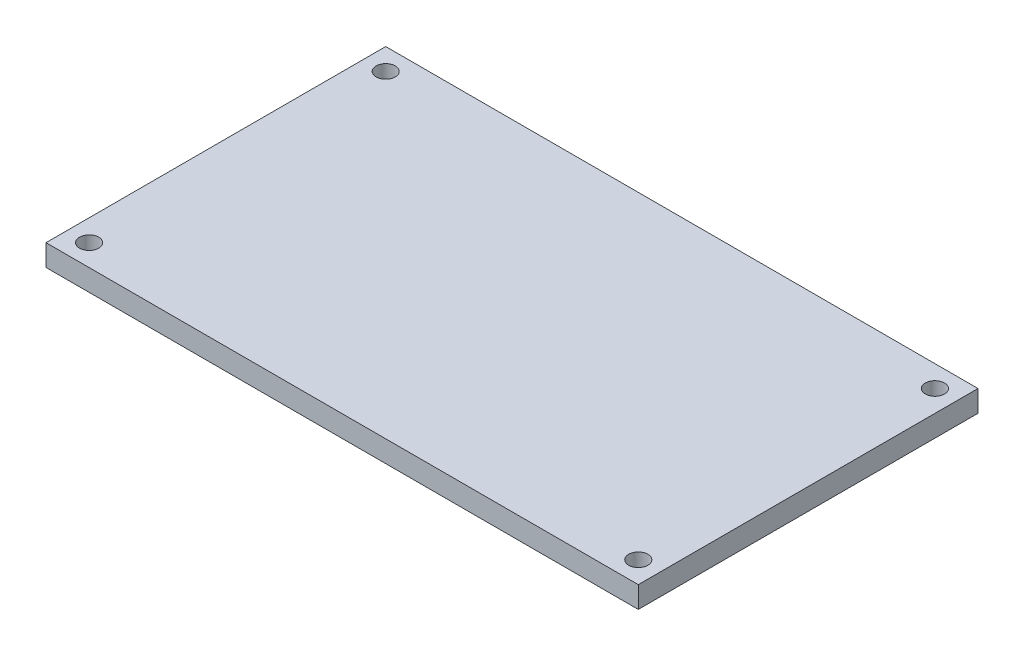
ISO-10303-21;
HEADER;
FILE_DESCRIPTION(('STEP AP214'),'2;1');
FILE_NAME('part.step','',(''),(''),'','','');
FILE_SCHEMA(('AUTOMOTIVE_DESIGN { 1 0 10303 214 1 1 1 1 }'));
ENDSEC;
DATA;
#1=APPLICATION_CONTEXT('core data for automotive mechanical design processes');
#2=APPLICATION_PROTOCOL_DEFINITION('international standard','automotive_design',2000,#1);
#3=PRODUCT_CONTEXT('',#1,'mechanical');
#4=PRODUCT('Part','Part','',(#3));
#5=PRODUCT_RELATED_PRODUCT_CATEGORY('part','',(#4));
#6=PRODUCT_DEFINITION_FORMATION('','',#4);
#7=PRODUCT_DEFINITION_CONTEXT('part definition',#1,'design');
#8=PRODUCT_DEFINITION('design','',#6,#7);
#9=PRODUCT_DEFINITION_SHAPE('','',#8);
#10=(LENGTH_UNIT() NAMED_UNIT(*) SI_UNIT(.MILLI.,.METRE.));
#11=(NAMED_UNIT(*) PLANE_ANGLE_UNIT() SI_UNIT($,.RADIAN.));
#12=(NAMED_UNIT(*) SI_UNIT($,.STERADIAN.) SOLID_ANGLE_UNIT());
#13=UNCERTAINTY_MEASURE_WITH_UNIT(LENGTH_MEASURE(1.E-05),#10,'distance_accuracy_value','');
#14=(GEOMETRIC_REPRESENTATION_CONTEXT(3) GLOBAL_UNCERTAINTY_ASSIGNED_CONTEXT((#13)) GLOBAL_UNIT_ASSIGNED_CONTEXT((#10,
#11,#12)) REPRESENTATION_CONTEXT('',''));
#15=CARTESIAN_POINT('',(0.,0.,0.));
#16=DIRECTION('',(0.,0.,1.));
#17=DIRECTION('',(1.,0.,0.));
#18=AXIS2_PLACEMENT_3D('',#15,#16,#17);
#19=CARTESIAN_POINT('',(43.735,3.175,-25.085));
#20=DIRECTION('',(-1.,0.,0.));
#21=DIRECTION('',(0.,0.,1.));
#22=AXIS2_PLACEMENT_3D('',#19,#20,#21);
#23=PLANE('',#22);
#24=DIRECTION('',(0.,0.,-1.));
#25=VECTOR('',#24,1.);
#26=CARTESIAN_POINT('',(43.735,0.,-25.085));
#27=LINE('',#26,#25);
#28=CARTESIAN_POINT('',(43.735,0.,25.085));
#29=VERTEX_POINT('',#28);
#30=CARTESIAN_POINT('',(43.735,0.,-25.085));
#31=VERTEX_POINT('',#30);
#32=EDGE_CURVE('E99',#29,#31,#27,.T.);
#33=ORIENTED_EDGE('',*,*,#32,.T.);
#34=DIRECTION('',(0.,-1.,0.));
#35=VECTOR('',#34,1.);
#36=CARTESIAN_POINT('',(43.735,3.175,-25.085));
#37=LINE('',#36,#35);
#38=CARTESIAN_POINT('',(43.735,3.175,-25.085));
#39=VERTEX_POINT('',#38);
#40=EDGE_CURVE('E11',#39,#31,#37,.T.);
#41=ORIENTED_EDGE('',*,*,#40,.F.);
#42=DIRECTION('',(0.,0.,-1.));
#43=VECTOR('',#42,1.);
#44=CARTESIAN_POINT('',(43.735,3.175,-25.085));
#45=LINE('',#44,#43);
#46=CARTESIAN_POINT('',(43.735,3.175,25.085));
#47=VERTEX_POINT('',#46);
#48=EDGE_CURVE('E87',#47,#39,#45,.T.);
#49=ORIENTED_EDGE('',*,*,#48,.F.);
#50=DIRECTION('',(0.,-1.,0.));
#51=VECTOR('',#50,1.);
#52=CARTESIAN_POINT('',(43.735,3.175,25.085));
#53=LINE('',#52,#51);
#54=EDGE_CURVE('E95',#47,#29,#53,.T.);
#55=ORIENTED_EDGE('',*,*,#54,.T.);
#56=EDGE_LOOP('',(#33,#41,#49,#55));
#57=FACE_BOUND('',#56,.T.);
#58=ADVANCED_FACE('F36',(#57),#23,.F.);
#59=CARTESIAN_POINT('',(-43.735,3.175,-25.085));
#60=DIRECTION('',(0.,0.,1.));
#61=DIRECTION('',(1.,0.,0.));
#62=AXIS2_PLACEMENT_3D('',#59,#60,#61);
#63=PLANE('',#62);
#64=DIRECTION('',(-1.,0.,0.));
#65=VECTOR('',#64,1.);
#66=CARTESIAN_POINT('',(-43.735,0.,-25.085));
#67=LINE('',#66,#65);
#68=CARTESIAN_POINT('',(-43.735,0.,-25.085));
#69=VERTEX_POINT('',#68);
#70=EDGE_CURVE('E91',#31,#69,#67,.T.);
#71=ORIENTED_EDGE('',*,*,#70,.T.);
#72=DIRECTION('',(0.,-1.,0.));
#73=VECTOR('',#72,1.);
#74=CARTESIAN_POINT('',(-43.735,3.175,-25.085));
#75=LINE('',#74,#73);
#76=CARTESIAN_POINT('',(-43.735,3.175,-25.085));
#77=VERTEX_POINT('',#76);
#78=EDGE_CURVE('E44',#77,#69,#75,.T.);
#79=ORIENTED_EDGE('',*,*,#78,.F.);
#80=DIRECTION('',(-1.,0.,0.));
#81=VECTOR('',#80,1.);
#82=CARTESIAN_POINT('',(-43.735,3.175,-25.085));
#83=LINE('',#82,#81);
#84=EDGE_CURVE('E82',#39,#77,#83,.T.);
#85=ORIENTED_EDGE('',*,*,#84,.F.);
#86=ORIENTED_EDGE('',*,*,#40,.T.);
#87=EDGE_LOOP('',(#71,#79,#85,#86));
#88=FACE_BOUND('',#87,.T.);
#89=ADVANCED_FACE('F90',(#88),#63,.F.);
#90=CARTESIAN_POINT('',(-43.735,3.175,-25.085));
#91=DIRECTION('',(1.,0.,0.));
#92=DIRECTION('',(0.,0.,-1.));
#93=AXIS2_PLACEMENT_3D('',#90,#91,#92);
#94=PLANE('',#93);
#95=DIRECTION('',(0.,0.,1.));
#96=VECTOR('',#95,1.);
#97=CARTESIAN_POINT('',(-43.735,0.,-25.085));
#98=LINE('',#97,#96);
#99=CARTESIAN_POINT('',(-43.735,0.,25.085));
#100=VERTEX_POINT('',#99);
#101=EDGE_CURVE('E69',#69,#100,#98,.T.);
#102=ORIENTED_EDGE('',*,*,#101,.T.);
#103=DIRECTION('',(0.,-1.,0.));
#104=VECTOR('',#103,1.);
#105=CARTESIAN_POINT('',(-43.735,3.175,25.085));
#106=LINE('',#105,#104);
#107=CARTESIAN_POINT('',(-43.735,3.175,25.085));
#108=VERTEX_POINT('',#107);
#109=EDGE_CURVE('E92',#108,#100,#106,.T.);
#110=ORIENTED_EDGE('',*,*,#109,.F.);
#111=DIRECTION('',(0.,0.,1.));
#112=VECTOR('',#111,1.);
#113=CARTESIAN_POINT('',(-43.735,3.175,-25.085));
#114=LINE('',#113,#112);
#115=EDGE_CURVE('E85',#77,#108,#114,.T.);
#116=ORIENTED_EDGE('',*,*,#115,.F.);
#117=ORIENTED_EDGE('',*,*,#78,.T.);
#118=EDGE_LOOP('',(#102,#110,#116,#117));
#119=FACE_BOUND('',#118,.T.);
#120=ADVANCED_FACE('F93',(#119),#94,.F.);
#121=CARTESIAN_POINT('',(-43.735,3.175,25.085));
#122=DIRECTION('',(0.,0.,-1.));
#123=DIRECTION('',(-1.,0.,0.));
#124=AXIS2_PLACEMENT_3D('',#121,#122,#123);
#125=PLANE('',#124);
#126=DIRECTION('',(1.,0.,0.));
#127=VECTOR('',#126,1.);
#128=CARTESIAN_POINT('',(-43.735,0.,25.085));
#129=LINE('',#128,#127);
#130=EDGE_CURVE('E75',#100,#29,#129,.T.);
#131=ORIENTED_EDGE('',*,*,#130,.T.);
#132=ORIENTED_EDGE('',*,*,#54,.F.);
#133=DIRECTION('',(1.,0.,0.));
#134=VECTOR('',#133,1.);
#135=CARTESIAN_POINT('',(-43.735,3.175,25.085));
#136=LINE('',#135,#134);
#137=EDGE_CURVE('E52',#108,#47,#136,.T.);
#138=ORIENTED_EDGE('',*,*,#137,.F.);
#139=ORIENTED_EDGE('',*,*,#109,.T.);
#140=EDGE_LOOP('',(#131,#132,#138,#139));
#141=FACE_BOUND('',#140,.T.);
#142=ADVANCED_FACE('F107',(#141),#125,.F.);
#143=CARTESIAN_POINT('',(0.,3.175,0.));
#144=DIRECTION('',(0.,1.,0.));
#145=DIRECTION('',(0.,0.,1.));
#146=AXIS2_PLACEMENT_3D('',#143,#144,#145);
#147=PLANE('',#146);
#148=CARTESIAN_POINT('',(-40.5530194846606,3.175,-21.9030194846605));
#149=DIRECTION('',(0.,1.,0.));
#150=DIRECTION('',(0.,0.,-1.));
#151=AXIS2_PLACEMENT_3D('',#148,#149,#150);
#152=CIRCLE('',#151,1.415);
#153=CARTESIAN_POINT('',(-40.5530194846606,3.175,-23.3180194846605));
#154=VERTEX_POINT('',#153);
#155=EDGE_CURVE('E119',#154,#154,#152,.T.);
#156=ORIENTED_EDGE('',*,*,#155,.F.);
#157=EDGE_LOOP('',(#156));
#158=FACE_BOUND('',#157,.T.);
#159=CARTESIAN_POINT('',(40.5530194846605,3.175,-21.9030194846605));
#160=DIRECTION('',(0.,1.,0.));
#161=DIRECTION('',(0.,0.,1.));
#162=AXIS2_PLACEMENT_3D('',#159,#160,#161);
#163=CIRCLE('',#162,1.415);
#164=CARTESIAN_POINT('',(40.5530194846605,3.175,-20.4880194846605));
#165=VERTEX_POINT('',#164);
#166=EDGE_CURVE('E125',#165,#165,#163,.T.);
#167=ORIENTED_EDGE('',*,*,#166,.F.);
#168=EDGE_LOOP('',(#167));
#169=FACE_BOUND('',#168,.T.);
#170=CARTESIAN_POINT('',(40.5530194846605,3.175,21.9030194846605));
#171=DIRECTION('',(0.,1.,0.));
#172=DIRECTION('',(0.,0.,-1.));
#173=AXIS2_PLACEMENT_3D('',#170,#171,#172);
#174=CIRCLE('',#173,1.415);
#175=CARTESIAN_POINT('',(40.5530194846605,3.175,20.4880194846605));
#176=VERTEX_POINT('',#175);
#177=EDGE_CURVE('E131',#176,#176,#174,.T.);
#178=ORIENTED_EDGE('',*,*,#177,.F.);
#179=EDGE_LOOP('',(#178));
#180=FACE_BOUND('',#179,.T.);
#181=CARTESIAN_POINT('',(-40.5530194846605,3.175,21.9030194846605));
#182=DIRECTION('',(0.,1.,0.));
#183=DIRECTION('',(0.,0.,1.));
#184=AXIS2_PLACEMENT_3D('',#181,#182,#183);
#185=CIRCLE('',#184,1.415);
#186=CARTESIAN_POINT('',(-40.5530194846605,3.175,23.3180194846605));
#187=VERTEX_POINT('',#186);
#188=EDGE_CURVE('E113',#187,#187,#185,.T.);
#189=ORIENTED_EDGE('',*,*,#188,.F.);
#190=EDGE_LOOP('',(#189));
#191=FACE_BOUND('',#190,.T.);
#192=ORIENTED_EDGE('',*,*,#48,.T.);
#193=ORIENTED_EDGE('',*,*,#84,.T.);
#194=ORIENTED_EDGE('',*,*,#115,.T.);
#195=ORIENTED_EDGE('',*,*,#137,.T.);
#196=EDGE_LOOP('',(#192,#193,#194,#195));
#197=FACE_BOUND('',#196,.T.);
#198=ADVANCED_FACE('F83',(#158,#169,#180,#191,#197),#147,.T.);
#199=CARTESIAN_POINT('',(0.,0.,0.));
#200=DIRECTION('',(0.,1.,0.));
#201=DIRECTION('',(0.,0.,1.));
#202=AXIS2_PLACEMENT_3D('',#199,#200,#201);
#203=PLANE('',#202);
#204=CARTESIAN_POINT('',(-40.5530194846606,0.,-21.9030194846605));
#205=DIRECTION('',(0.,1.,0.));
#206=DIRECTION('',(0.,0.,-1.));
#207=AXIS2_PLACEMENT_3D('',#204,#205,#206);
#208=CIRCLE('',#207,1.415);
#209=CARTESIAN_POINT('',(-40.5530194846606,0.,-23.3180194846605));
#210=VERTEX_POINT('',#209);
#211=EDGE_CURVE('E122',#210,#210,#208,.T.);
#212=ORIENTED_EDGE('',*,*,#211,.T.);
#213=EDGE_LOOP('',(#212));
#214=FACE_BOUND('',#213,.T.);
#215=CARTESIAN_POINT('',(40.5530194846605,0.,-21.9030194846605));
#216=DIRECTION('',(0.,1.,0.));
#217=DIRECTION('',(0.,0.,1.));
#218=AXIS2_PLACEMENT_3D('',#215,#216,#217);
#219=CIRCLE('',#218,1.415);
#220=CARTESIAN_POINT('',(40.5530194846605,0.,-20.4880194846605));
#221=VERTEX_POINT('',#220);
#222=EDGE_CURVE('E128',#221,#221,#219,.T.);
#223=ORIENTED_EDGE('',*,*,#222,.T.);
#224=EDGE_LOOP('',(#223));
#225=FACE_BOUND('',#224,.T.);
#226=CARTESIAN_POINT('',(40.5530194846605,0.,21.9030194846605));
#227=DIRECTION('',(0.,1.,0.));
#228=DIRECTION('',(0.,0.,-1.));
#229=AXIS2_PLACEMENT_3D('',#226,#227,#228);
#230=CIRCLE('',#229,1.415);
#231=CARTESIAN_POINT('',(40.5530194846605,0.,20.4880194846605));
#232=VERTEX_POINT('',#231);
#233=EDGE_CURVE('E116',#232,#232,#230,.T.);
#234=ORIENTED_EDGE('',*,*,#233,.T.);
#235=EDGE_LOOP('',(#234));
#236=FACE_BOUND('',#235,.T.);
#237=CARTESIAN_POINT('',(-40.5530194846605,0.,21.9030194846605));
#238=DIRECTION('',(0.,1.,0.));
#239=DIRECTION('',(0.,0.,1.));
#240=AXIS2_PLACEMENT_3D('',#237,#238,#239);
#241=CIRCLE('',#240,1.415);
#242=CARTESIAN_POINT('',(-40.5530194846605,0.,23.3180194846605));
#243=VERTEX_POINT('',#242);
#244=EDGE_CURVE('E102',#243,#243,#241,.T.);
#245=ORIENTED_EDGE('',*,*,#244,.T.);
#246=EDGE_LOOP('',(#245));
#247=FACE_BOUND('',#246,.T.);
#248=ORIENTED_EDGE('',*,*,#32,.F.);
#249=ORIENTED_EDGE('',*,*,#130,.F.);
#250=ORIENTED_EDGE('',*,*,#101,.F.);
#251=ORIENTED_EDGE('',*,*,#70,.F.);
#252=EDGE_LOOP('',(#248,#249,#250,#251));
#253=FACE_BOUND('',#252,.T.);
#254=ADVANCED_FACE('F110',(#214,#225,#236,#247,#253),#203,.F.);
#255=CARTESIAN_POINT('',(-40.5530194846605,0.,21.9030194846605));
#256=DIRECTION('',(0.,1.,0.));
#257=DIRECTION('',(0.,0.,1.));
#258=AXIS2_PLACEMENT_3D('',#255,#256,#257);
#259=CYLINDRICAL_SURFACE('',#258,1.415);
#260=ORIENTED_EDGE('',*,*,#244,.F.);
#261=EDGE_LOOP('',(#260));
#262=FACE_BOUND('',#261,.T.);
#263=ORIENTED_EDGE('',*,*,#188,.T.);
#264=EDGE_LOOP('',(#263));
#265=FACE_BOUND('',#264,.T.);
#266=ADVANCED_FACE('F143',(#262,#265),#259,.F.);
#267=CARTESIAN_POINT('',(40.5530194846605,0.,21.9030194846605));
#268=DIRECTION('',(0.,1.,0.));
#269=DIRECTION('',(0.,0.,1.));
#270=AXIS2_PLACEMENT_3D('',#267,#268,#269);
#271=CYLINDRICAL_SURFACE('',#270,1.415);
#272=ORIENTED_EDGE('',*,*,#233,.F.);
#273=EDGE_LOOP('',(#272));
#274=FACE_BOUND('',#273,.T.);
#275=ORIENTED_EDGE('',*,*,#177,.T.);
#276=EDGE_LOOP('',(#275));
#277=FACE_BOUND('',#276,.T.);
#278=ADVANCED_FACE('F139',(#274,#277),#271,.F.);
#279=CARTESIAN_POINT('',(40.5530194846605,0.,-21.9030194846605));
#280=DIRECTION('',(0.,1.,0.));
#281=DIRECTION('',(0.,0.,1.));
#282=AXIS2_PLACEMENT_3D('',#279,#280,#281);
#283=CYLINDRICAL_SURFACE('',#282,1.415);
#284=ORIENTED_EDGE('',*,*,#222,.F.);
#285=EDGE_LOOP('',(#284));
#286=FACE_BOUND('',#285,.T.);
#287=ORIENTED_EDGE('',*,*,#166,.T.);
#288=EDGE_LOOP('',(#287));
#289=FACE_BOUND('',#288,.T.);
#290=ADVANCED_FACE('F142',(#286,#289),#283,.F.);
#291=CARTESIAN_POINT('',(-40.5530194846606,0.,-21.9030194846605));
#292=DIRECTION('',(0.,1.,0.));
#293=DIRECTION('',(0.,0.,1.));
#294=AXIS2_PLACEMENT_3D('',#291,#292,#293);
#295=CYLINDRICAL_SURFACE('',#294,1.415);
#296=ORIENTED_EDGE('',*,*,#211,.F.);
#297=EDGE_LOOP('',(#296));
#298=FACE_BOUND('',#297,.T.);
#299=ORIENTED_EDGE('',*,*,#155,.T.);
#300=EDGE_LOOP('',(#299));
#301=FACE_BOUND('',#300,.T.);
#302=ADVANCED_FACE('F204',(#298,#301),#295,.F.);
#303=CLOSED_SHELL('',(#58,#89,#120,#142,#198,#254,#266,#278,#290,#302));
#304=MANIFOLD_SOLID_BREP('B2',#303);
#305=ADVANCED_BREP_SHAPE_REPRESENTATION('',(#18,#304),#14);
#306=SHAPE_DEFINITION_REPRESENTATION(#9,#305);
ENDSEC;
END-ISO-10303-21;
